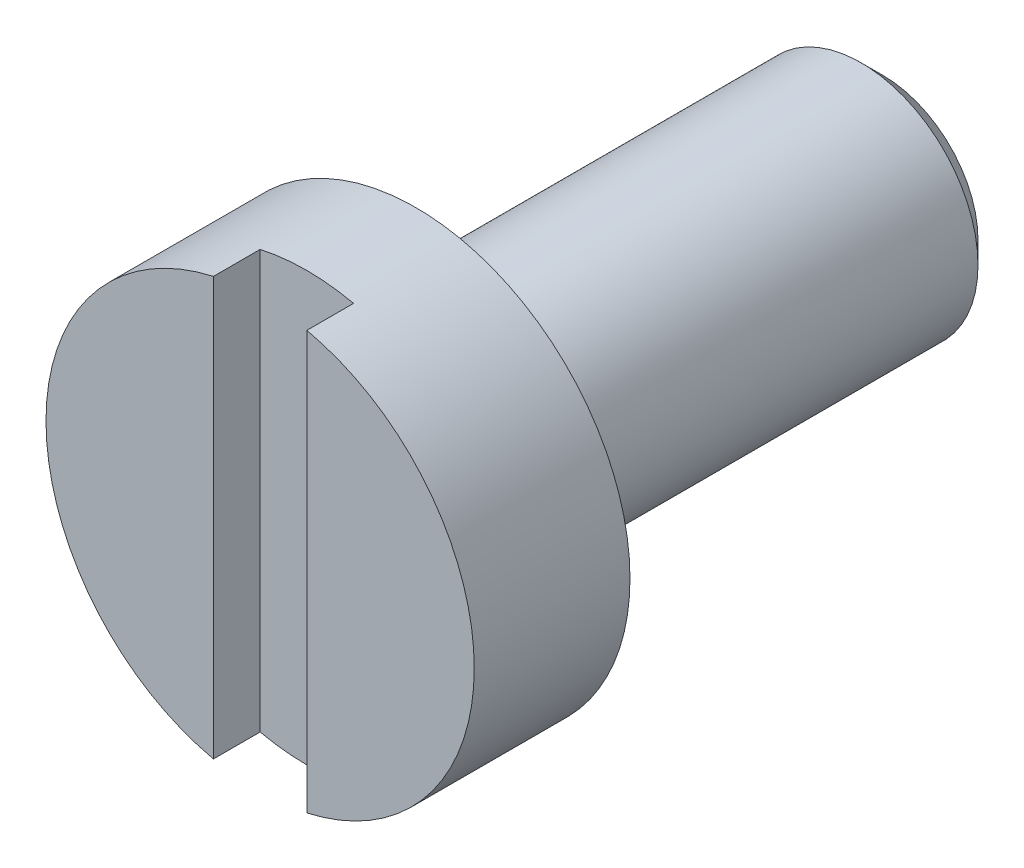
ISO-10303-21;
HEADER;
FILE_DESCRIPTION(('STEP AP214'),'2;1');
FILE_NAME('part.step','',(''),(''),'','','');
FILE_SCHEMA(('AUTOMOTIVE_DESIGN { 1 0 10303 214 1 1 1 1 }'));
ENDSEC;
DATA;
#1=APPLICATION_CONTEXT('core data for automotive mechanical design processes');
#2=APPLICATION_PROTOCOL_DEFINITION('international standard','automotive_design',2000,#1);
#3=PRODUCT_CONTEXT('',#1,'mechanical');
#4=PRODUCT('Part','Part','',(#3));
#5=PRODUCT_RELATED_PRODUCT_CATEGORY('part','',(#4));
#6=PRODUCT_DEFINITION_FORMATION('','',#4);
#7=PRODUCT_DEFINITION_CONTEXT('part definition',#1,'design');
#8=PRODUCT_DEFINITION('design','',#6,#7);
#9=PRODUCT_DEFINITION_SHAPE('','',#8);
#10=(LENGTH_UNIT() NAMED_UNIT(*) SI_UNIT(.MILLI.,.METRE.));
#11=(NAMED_UNIT(*) PLANE_ANGLE_UNIT() SI_UNIT($,.RADIAN.));
#12=(NAMED_UNIT(*) SI_UNIT($,.STERADIAN.) SOLID_ANGLE_UNIT());
#13=UNCERTAINTY_MEASURE_WITH_UNIT(LENGTH_MEASURE(1.E-05),#10,'distance_accuracy_value','');
#14=(GEOMETRIC_REPRESENTATION_CONTEXT(3) GLOBAL_UNCERTAINTY_ASSIGNED_CONTEXT((#13)) GLOBAL_UNIT_ASSIGNED_CONTEXT((#10,
#11,#12)) REPRESENTATION_CONTEXT('',''));
#15=CARTESIAN_POINT('',(0.,0.,0.));
#16=DIRECTION('',(0.,0.,1.));
#17=DIRECTION('',(1.,0.,0.));
#18=AXIS2_PLACEMENT_3D('',#15,#16,#17);
#19=CARTESIAN_POINT('',(-4.57966997657877E-13,0.,2.));
#20=DIRECTION('',(0.,0.,-0.999999999999829));
#21=DIRECTION('',(-1.00000000000016,0.,0.));
#22=AXIS2_PLACEMENT_3D('',#19,#20,#21);
#23=CYLINDRICAL_SURFACE('',#22,2.75);
#24=CARTESIAN_POINT('',(0.,0.,0.));
#25=DIRECTION('',(0.,0.,0.999999999999829));
#26=DIRECTION('',(1.00000000000016,0.,0.));
#27=AXIS2_PLACEMENT_3D('',#24,#25,#26);
#28=CIRCLE('',#27,2.75);
#29=CARTESIAN_POINT('',(2.75000000000044,0.,0.));
#30=VERTEX_POINT('',#29);
#31=EDGE_CURVE('E112',#30,#30,#28,.T.);
#32=ORIENTED_EDGE('',*,*,#31,.T.);
#33=EDGE_LOOP('',(#32));
#34=FACE_BOUND('',#33,.T.);
#35=DIRECTION('',(0.,0.,-0.999999999999829));
#36=VECTOR('',#35,1.);
#37=CARTESIAN_POINT('',(0.600000000000069,-2.68374738006429,2.00000000000029));
#38=LINE('',#37,#36);
#39=CARTESIAN_POINT('',(0.599999999999953,-2.68374738006426,1.40000000000029));
#40=VERTEX_POINT('',#39);
#41=CARTESIAN_POINT('',(0.600000000000069,-2.68374738006429,2.00000000000029));
#42=VERTEX_POINT('',#41);
#43=EDGE_CURVE('E71',#40,#42,#38,.F.);
#44=ORIENTED_EDGE('',*,*,#43,.F.);
#45=CARTESIAN_POINT('',(-4.68375338513738E-13,0.,1.4));
#46=DIRECTION('',(0.,0.,0.999999999999829));
#47=DIRECTION('',(1.00000000000016,0.,0.));
#48=AXIS2_PLACEMENT_3D('',#45,#46,#47);
#49=CIRCLE('',#48,2.75);
#50=CARTESIAN_POINT('',(-0.600000000000458,-2.6837473800649,1.39999999999999));
#51=VERTEX_POINT('',#50);
#52=EDGE_CURVE('E13',#51,#40,#49,.T.);
#53=ORIENTED_EDGE('',*,*,#52,.F.);
#54=DIRECTION('',(0.,0.,-0.999999999999829));
#55=VECTOR('',#54,1.);
#56=CARTESIAN_POINT('',(-0.600000000000458,-2.6837473800649,1.99999999999999));
#57=LINE('',#56,#55);
#58=CARTESIAN_POINT('',(-0.600000000000458,-2.6837473800649,1.99999999999999));
#59=VERTEX_POINT('',#58);
#60=EDGE_CURVE('E100',#59,#51,#57,.T.);
#61=ORIENTED_EDGE('',*,*,#60,.F.);
#62=CARTESIAN_POINT('',(-4.57966997657877E-13,0.,2.));
#63=DIRECTION('',(0.,0.,0.999999999999829));
#64=DIRECTION('',(1.00000000000016,0.,0.));
#65=AXIS2_PLACEMENT_3D('',#62,#63,#64);
#66=CIRCLE('',#65,2.75);
#67=CARTESIAN_POINT('',(-0.600000000000028,2.68374738006386,1.99999999999999));
#68=VERTEX_POINT('',#67);
#69=EDGE_CURVE('E104',#68,#59,#66,.T.);
#70=ORIENTED_EDGE('',*,*,#69,.F.);
#71=DIRECTION('',(0.,0.,-0.999999999999829));
#72=VECTOR('',#71,1.);
#73=CARTESIAN_POINT('',(-0.600000000000028,2.68374738006386,1.99999999999999));
#74=LINE('',#73,#72);
#75=CARTESIAN_POINT('',(-0.599999999999996,2.68374738006386,1.39999999999999));
#76=VERTEX_POINT('',#75);
#77=EDGE_CURVE('E63',#76,#68,#74,.F.);
#78=ORIENTED_EDGE('',*,*,#77,.F.);
#79=CARTESIAN_POINT('',(0.599999999999989,2.68374738006405,1.39999999999999));
#80=VERTEX_POINT('',#79);
#81=EDGE_CURVE('E52',#80,#76,#49,.T.);
#82=ORIENTED_EDGE('',*,*,#81,.F.);
#83=DIRECTION('',(0.,0.,-0.999999999999829));
#84=VECTOR('',#83,1.);
#85=CARTESIAN_POINT('',(0.599999999999979,2.68374738006407,1.99999999999999));
#86=LINE('',#85,#84);
#87=CARTESIAN_POINT('',(0.599999999999979,2.68374738006407,1.99999999999999));
#88=VERTEX_POINT('',#87);
#89=EDGE_CURVE('E110',#88,#80,#86,.T.);
#90=ORIENTED_EDGE('',*,*,#89,.F.);
#91=EDGE_CURVE('E113',#42,#88,#66,.T.);
#92=ORIENTED_EDGE('',*,*,#91,.F.);
#93=EDGE_LOOP('',(#44,#53,#61,#70,#78,#82,#90,#92));
#94=FACE_BOUND('',#93,.T.);
#95=ADVANCED_FACE('F48',(#34,#94),#23,.T.);
#96=CARTESIAN_POINT('',(-4.57966997657877E-13,0.,2.));
#97=DIRECTION('',(0.,0.,0.999999999999829));
#98=DIRECTION('',(1.00000000000016,0.,0.));
#99=AXIS2_PLACEMENT_3D('',#96,#97,#98);
#100=PLANE('',#99);
#101=ORIENTED_EDGE('',*,*,#91,.T.);
#102=DIRECTION('',(0.,-1.00000000000016,0.));
#103=VECTOR('',#102,1.);
#104=CARTESIAN_POINT('',(0.599999999999573,0.,1.99999999999997));
#105=LINE('',#104,#103);
#106=EDGE_CURVE('E97',#88,#42,#105,.T.);
#107=ORIENTED_EDGE('',*,*,#106,.T.);
#108=EDGE_LOOP('',(#101,#107));
#109=FACE_BOUND('',#108,.T.);
#110=ADVANCED_FACE('F130',(#109),#100,.T.);
#111=ORIENTED_EDGE('',*,*,#69,.T.);
#112=DIRECTION('',(0.,1.00000000000016,0.));
#113=VECTOR('',#112,1.);
#114=CARTESIAN_POINT('',(-0.600000000000454,0.,2.));
#115=LINE('',#114,#113);
#116=EDGE_CURVE('E127',#59,#68,#115,.T.);
#117=ORIENTED_EDGE('',*,*,#116,.T.);
#118=EDGE_LOOP('',(#111,#117));
#119=FACE_BOUND('',#118,.T.);
#120=ADVANCED_FACE('F146',(#119),#100,.T.);
#121=CARTESIAN_POINT('',(0.,0.,0.));
#122=DIRECTION('',(0.,0.,0.999999999999829));
#123=DIRECTION('',(1.00000000000016,0.,0.));
#124=AXIS2_PLACEMENT_3D('',#121,#122,#123);
#125=PLANE('',#124);
#126=ORIENTED_EDGE('',*,*,#31,.F.);
#127=EDGE_LOOP('',(#126));
#128=FACE_BOUND('',#127,.T.);
#129=CARTESIAN_POINT('',(0.,0.,0.));
#130=DIRECTION('',(0.,0.,0.999999999999829));
#131=DIRECTION('',(1.00000000000016,0.,0.));
#132=AXIS2_PLACEMENT_3D('',#129,#130,#131);
#133=CIRCLE('',#132,1.5);
#134=CARTESIAN_POINT('',(1.50000000000024,0.,0.));
#135=VERTEX_POINT('',#134);
#136=EDGE_CURVE('E118',#135,#135,#133,.F.);
#137=ORIENTED_EDGE('',*,*,#136,.F.);
#138=EDGE_LOOP('',(#137));
#139=FACE_BOUND('',#138,.T.);
#140=ADVANCED_FACE('F149',(#128,#139),#125,.F.);
#141=CARTESIAN_POINT('',(0.,0.,-5.9999999999991));
#142=DIRECTION('',(0.,0.,0.999999999999829));
#143=DIRECTION('',(1.00000000000016,0.,0.));
#144=AXIS2_PLACEMENT_3D('',#141,#142,#143);
#145=CYLINDRICAL_SURFACE('',#144,1.5);
#146=CARTESIAN_POINT('',(0.,0.,-5.7194999999991));
#147=DIRECTION('',(0.,0.,-0.999999999999829));
#148=DIRECTION('',(-1.00000000000016,0.,0.));
#149=AXIS2_PLACEMENT_3D('',#146,#147,#148);
#150=CIRCLE('',#149,1.5);
#151=CARTESIAN_POINT('',(-1.50000000000024,0.,-5.7194999999991));
#152=VERTEX_POINT('',#151);
#153=EDGE_CURVE('E124',#152,#152,#150,.F.);
#154=ORIENTED_EDGE('',*,*,#153,.T.);
#155=EDGE_LOOP('',(#154));
#156=FACE_BOUND('',#155,.T.);
#157=ORIENTED_EDGE('',*,*,#136,.T.);
#158=EDGE_LOOP('',(#157));
#159=FACE_BOUND('',#158,.T.);
#160=ADVANCED_FACE('F151',(#156,#159),#145,.T.);
#161=CARTESIAN_POINT('',(0.,0.,-5.9999999999991));
#162=DIRECTION('',(0.,0.,-0.999999999999829));
#163=DIRECTION('',(-1.00000000000016,0.,0.));
#164=AXIS2_PLACEMENT_3D('',#161,#162,#163);
#165=PLANE('',#164);
#166=CARTESIAN_POINT('',(0.,0.,-5.9999999999991));
#167=DIRECTION('',(0.,0.,-0.999999999999829));
#168=DIRECTION('',(-1.00000000000016,0.,0.));
#169=AXIS2_PLACEMENT_3D('',#166,#167,#168);
#170=CIRCLE('',#169,1.2195);
#171=CARTESIAN_POINT('',(-1.2195000000002,0.,-5.9999999999991));
#172=VERTEX_POINT('',#171);
#173=EDGE_CURVE('E121',#172,#172,#170,.T.);
#174=ORIENTED_EDGE('',*,*,#173,.T.);
#175=EDGE_LOOP('',(#174));
#176=FACE_BOUND('',#175,.T.);
#177=ADVANCED_FACE('F155',(#176),#165,.T.);
#178=CARTESIAN_POINT('',(0.,0.,-5.9999999999991));
#179=DIRECTION('',(0.,0.,0.999999999999829));
#180=DIRECTION('',(1.00000000000016,0.,0.));
#181=AXIS2_PLACEMENT_3D('',#178,#179,#180);
#182=CONICAL_SURFACE('',#181,1.2195,0.785398163397442);
#183=ORIENTED_EDGE('',*,*,#153,.F.);
#184=EDGE_LOOP('',(#183));
#185=FACE_BOUND('',#184,.T.);
#186=ORIENTED_EDGE('',*,*,#173,.F.);
#187=EDGE_LOOP('',(#186));
#188=FACE_BOUND('',#187,.T.);
#189=ADVANCED_FACE('F50',(#185,#188),#182,.T.);
#190=CARTESIAN_POINT('',(-0.600000000000434,38.0000000000048,1.40000000000029));
#191=DIRECTION('',(0.,0.,0.999999999999829));
#192=DIRECTION('',(1.00000000000016,0.,0.));
#193=AXIS2_PLACEMENT_3D('',#190,#191,#192);
#194=PLANE('',#193);
#195=ORIENTED_EDGE('',*,*,#81,.T.);
#196=DIRECTION('',(0.,-1.00000000000016,0.));
#197=VECTOR('',#196,1.);
#198=CARTESIAN_POINT('',(-0.600000000000434,38.0000000000048,1.40000000000029));
#199=LINE('',#198,#197);
#200=EDGE_CURVE('E92',#76,#51,#199,.T.);
#201=ORIENTED_EDGE('',*,*,#200,.T.);
#202=ORIENTED_EDGE('',*,*,#52,.T.);
#203=DIRECTION('',(0.,-1.00000000000016,0.));
#204=VECTOR('',#203,1.);
#205=CARTESIAN_POINT('',(0.599999999999601,38.0000000000065,1.40000000000029));
#206=LINE('',#205,#204);
#207=EDGE_CURVE('E94',#80,#40,#206,.T.);
#208=ORIENTED_EDGE('',*,*,#207,.F.);
#209=EDGE_LOOP('',(#195,#201,#202,#208));
#210=FACE_BOUND('',#209,.T.);
#211=ADVANCED_FACE('F91',(#210),#194,.T.);
#212=CARTESIAN_POINT('',(0.599999999999601,38.0000000000065,1.40000000000029));
#213=DIRECTION('',(-1.00000000000016,0.,0.));
#214=DIRECTION('',(0.,0.,0.999999999999829));
#215=AXIS2_PLACEMENT_3D('',#212,#213,#214);
#216=PLANE('',#215);
#217=ORIENTED_EDGE('',*,*,#89,.T.);
#218=ORIENTED_EDGE('',*,*,#207,.T.);
#219=ORIENTED_EDGE('',*,*,#43,.T.);
#220=ORIENTED_EDGE('',*,*,#106,.F.);
#221=EDGE_LOOP('',(#217,#218,#219,#220));
#222=FACE_BOUND('',#221,.T.);
#223=ADVANCED_FACE('F131',(#222),#216,.T.);
#224=CARTESIAN_POINT('',(-0.600000000000434,38.0000000000048,1.40000000000029));
#225=DIRECTION('',(1.00000000000016,0.,0.));
#226=DIRECTION('',(0.,0.,-0.999999999999829));
#227=AXIS2_PLACEMENT_3D('',#224,#225,#226);
#228=PLANE('',#227);
#229=ORIENTED_EDGE('',*,*,#60,.T.);
#230=ORIENTED_EDGE('',*,*,#200,.F.);
#231=ORIENTED_EDGE('',*,*,#77,.T.);
#232=ORIENTED_EDGE('',*,*,#116,.F.);
#233=EDGE_LOOP('',(#229,#230,#231,#232));
#234=FACE_BOUND('',#233,.T.);
#235=ADVANCED_FACE('F98',(#234),#228,.T.);
#236=CLOSED_SHELL('',(#95,#110,#120,#140,#160,#177,#189,#211,#223,#235));
#237=MANIFOLD_SOLID_BREP('B2',#236);
#238=ADVANCED_BREP_SHAPE_REPRESENTATION('',(#18,#237),#14);
#239=SHAPE_DEFINITION_REPRESENTATION(#9,#238);
ENDSEC;
END-ISO-10303-21;
